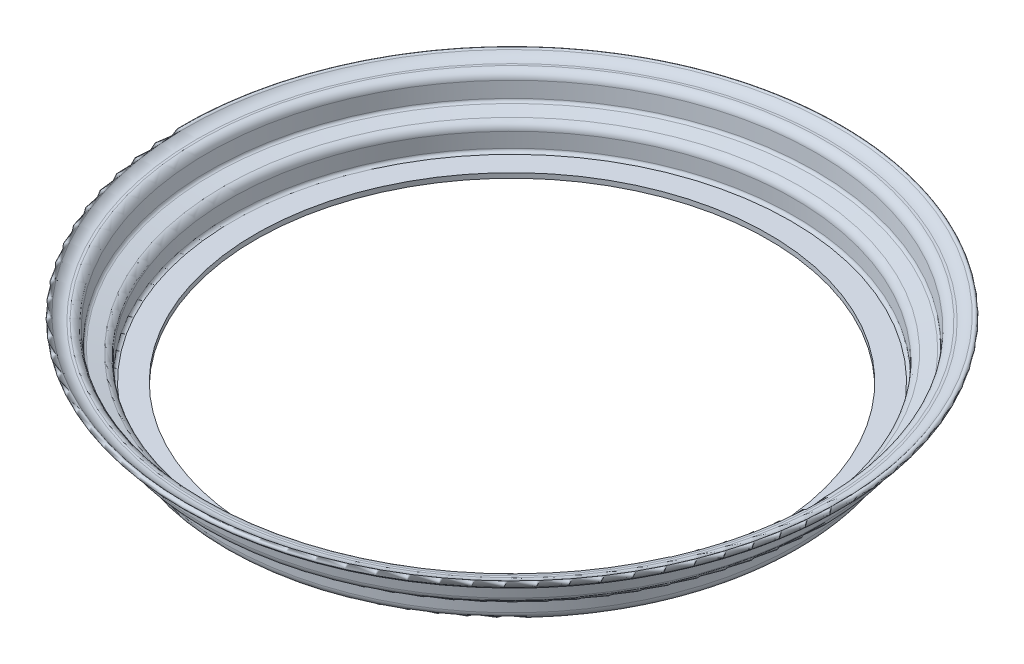
ISO-10303-21;
HEADER;
FILE_DESCRIPTION(('STEP AP214'),'2;1');
FILE_NAME('part.step','',(''),(''),'','','');
FILE_SCHEMA(('AUTOMOTIVE_DESIGN { 1 0 10303 214 1 1 1 1 }'));
ENDSEC;
DATA;
#1=APPLICATION_CONTEXT('core data for automotive mechanical design processes');
#2=APPLICATION_PROTOCOL_DEFINITION('international standard','automotive_design',2000,#1);
#3=PRODUCT_CONTEXT('',#1,'mechanical');
#4=PRODUCT('Part','Part','',(#3));
#5=PRODUCT_RELATED_PRODUCT_CATEGORY('part','',(#4));
#6=PRODUCT_DEFINITION_FORMATION('','',#4);
#7=PRODUCT_DEFINITION_CONTEXT('part definition',#1,'design');
#8=PRODUCT_DEFINITION('design','',#6,#7);
#9=PRODUCT_DEFINITION_SHAPE('','',#8);
#10=(LENGTH_UNIT() NAMED_UNIT(*) SI_UNIT(.MILLI.,.METRE.));
#11=(NAMED_UNIT(*) PLANE_ANGLE_UNIT() SI_UNIT($,.RADIAN.));
#12=(NAMED_UNIT(*) SI_UNIT($,.STERADIAN.) SOLID_ANGLE_UNIT());
#13=UNCERTAINTY_MEASURE_WITH_UNIT(LENGTH_MEASURE(1.E-05),#10,'distance_accuracy_value','');
#14=(GEOMETRIC_REPRESENTATION_CONTEXT(3) GLOBAL_UNCERTAINTY_ASSIGNED_CONTEXT((#13)) GLOBAL_UNIT_ASSIGNED_CONTEXT((#10,
#11,#12)) REPRESENTATION_CONTEXT('',''));
#15=CARTESIAN_POINT('',(0.,0.,0.));
#16=DIRECTION('',(0.,0.,1.));
#17=DIRECTION('',(1.,0.,0.));
#18=AXIS2_PLACEMENT_3D('',#15,#16,#17);
#19=CARTESIAN_POINT('',(0.,5.18,0.));
#20=DIRECTION('',(0.,1.,0.));
#21=DIRECTION('',(0.,0.,1.));
#22=AXIS2_PLACEMENT_3D('',#19,#20,#21);
#23=TOROIDAL_SURFACE('',#22,182.87389946701,5.17999999999999);
#24=CARTESIAN_POINT('',(0.,0.,0.));
#25=DIRECTION('',(0.,1.,0.));
#26=DIRECTION('',(0.,0.,1.));
#27=AXIS2_PLACEMENT_3D('',#24,#25,#26);
#28=CIRCLE('',#27,182.87389946701);
#29=CARTESIAN_POINT('',(0.,0.,182.87389946701));
#30=VERTEX_POINT('',#29);
#31=EDGE_CURVE('E10',#30,#30,#28,.T.);
#32=ORIENTED_EDGE('',*,*,#31,.T.);
#33=EDGE_LOOP('',(#32));
#34=FACE_BOUND('',#33,.T.);
#35=CARTESIAN_POINT('',(0.,5.18000000000005,0.));
#36=DIRECTION('',(0.,1.,0.));
#37=DIRECTION('',(0.,0.,1.));
#38=AXIS2_PLACEMENT_3D('',#35,#36,#37);
#39=CIRCLE('',#38,188.05389946701);
#40=CARTESIAN_POINT('',(0.,5.18000000000005,188.05389946701));
#41=VERTEX_POINT('',#40);
#42=EDGE_CURVE('E107',#41,#41,#39,.T.);
#43=ORIENTED_EDGE('',*,*,#42,.F.);
#44=EDGE_LOOP('',(#43));
#45=FACE_BOUND('',#44,.T.);
#46=ADVANCED_FACE('F37',(#34,#45),#23,.T.);
#47=CARTESIAN_POINT('',(-182.87389946701,0.,0.));
#48=DIRECTION('',(0.,-1.,0.));
#49=DIRECTION('',(0.,0.,-1.));
#50=AXIS2_PLACEMENT_3D('',#47,#48,#49);
#51=PLANE('',#50);
#52=CARTESIAN_POINT('',(0.,0.,0.));
#53=DIRECTION('',(0.,1.,0.));
#54=DIRECTION('',(0.,0.,1.));
#55=AXIS2_PLACEMENT_3D('',#52,#53,#54);
#56=CIRCLE('',#55,168.157575681218);
#57=CARTESIAN_POINT('',(0.,0.,168.157575681218));
#58=VERTEX_POINT('',#57);
#59=EDGE_CURVE('E43',#58,#58,#56,.T.);
#60=ORIENTED_EDGE('',*,*,#59,.T.);
#61=EDGE_LOOP('',(#60));
#62=FACE_BOUND('',#61,.T.);
#63=ORIENTED_EDGE('',*,*,#31,.F.);
#64=EDGE_LOOP('',(#63));
#65=FACE_BOUND('',#64,.T.);
#66=ADVANCED_FACE('F115',(#62,#65),#51,.T.);
#67=CARTESIAN_POINT('',(0.,240.88895216458,0.));
#68=DIRECTION('',(0.,1.,0.));
#69=DIRECTION('',(0.,0.,1.));
#70=AXIS2_PLACEMENT_3D('',#67,#68,#69);
#71=CYLINDRICAL_SURFACE('',#70,168.157575681218);
#72=CARTESIAN_POINT('',(0.,3.17500000000001,0.));
#73=DIRECTION('',(0.,1.,0.));
#74=DIRECTION('',(0.,0.,1.));
#75=AXIS2_PLACEMENT_3D('',#72,#73,#74);
#76=CIRCLE('',#75,168.157575681218);
#77=CARTESIAN_POINT('',(0.,3.17500000000001,168.157575681218));
#78=VERTEX_POINT('',#77);
#79=EDGE_CURVE('E47',#78,#78,#76,.T.);
#80=ORIENTED_EDGE('',*,*,#79,.T.);
#81=EDGE_LOOP('',(#80));
#82=FACE_BOUND('',#81,.T.);
#83=ORIENTED_EDGE('',*,*,#59,.F.);
#84=EDGE_LOOP('',(#83));
#85=FACE_BOUND('',#84,.T.);
#86=ADVANCED_FACE('F119',(#82,#85),#71,.F.);
#87=CARTESIAN_POINT('',(-182.87889946701,3.175,0.));
#88=DIRECTION('',(0.,1.,0.));
#89=DIRECTION('',(0.,0.,1.));
#90=AXIS2_PLACEMENT_3D('',#87,#88,#89);
#91=PLANE('',#90);
#92=CARTESIAN_POINT('',(0.,3.17500000000001,0.));
#93=DIRECTION('',(0.,1.,0.));
#94=DIRECTION('',(0.,0.,1.));
#95=AXIS2_PLACEMENT_3D('',#92,#93,#94);
#96=CIRCLE('',#95,182.87889946701);
#97=CARTESIAN_POINT('',(0.,3.17500000000001,182.87889946701));
#98=VERTEX_POINT('',#97);
#99=EDGE_CURVE('E51',#98,#98,#96,.T.);
#100=ORIENTED_EDGE('',*,*,#99,.T.);
#101=EDGE_LOOP('',(#100));
#102=FACE_BOUND('',#101,.T.);
#103=ORIENTED_EDGE('',*,*,#79,.F.);
#104=EDGE_LOOP('',(#103));
#105=FACE_BOUND('',#104,.T.);
#106=ADVANCED_FACE('F123',(#102,#105),#91,.T.);
#107=CARTESIAN_POINT('',(0.,5.175,0.));
#108=DIRECTION('',(0.,1.,0.));
#109=DIRECTION('',(0.,0.,1.));
#110=AXIS2_PLACEMENT_3D('',#107,#108,#109);
#111=TOROIDAL_SURFACE('',#110,182.87889946701,2.);
#112=CARTESIAN_POINT('',(0.,5.17500000000001,0.));
#113=DIRECTION('',(0.,1.,0.));
#114=DIRECTION('',(0.,0.,1.));
#115=AXIS2_PLACEMENT_3D('',#112,#113,#114);
#116=CIRCLE('',#115,184.87889946701);
#117=CARTESIAN_POINT('',(0.,5.17500000000001,184.87889946701));
#118=VERTEX_POINT('',#117);
#119=EDGE_CURVE('E56',#118,#118,#116,.T.);
#120=ORIENTED_EDGE('',*,*,#119,.T.);
#121=EDGE_LOOP('',(#120));
#122=FACE_BOUND('',#121,.T.);
#123=ORIENTED_EDGE('',*,*,#99,.F.);
#124=EDGE_LOOP('',(#123));
#125=FACE_BOUND('',#124,.T.);
#126=ADVANCED_FACE('F130',(#122,#125),#111,.F.);
#127=CARTESIAN_POINT('',(0.,240.88895216458,0.));
#128=DIRECTION('',(0.,1.,0.));
#129=DIRECTION('',(0.,0.,1.));
#130=AXIS2_PLACEMENT_3D('',#127,#128,#129);
#131=CYLINDRICAL_SURFACE('',#130,184.87889946701);
#132=CARTESIAN_POINT('',(0.,14.867499271066,0.));
#133=DIRECTION('',(0.,1.,0.));
#134=DIRECTION('',(0.,0.,1.));
#135=AXIS2_PLACEMENT_3D('',#132,#133,#134);
#136=CIRCLE('',#135,184.87889946701);
#137=CARTESIAN_POINT('',(0.,14.867499271066,184.87889946701));
#138=VERTEX_POINT('',#137);
#139=EDGE_CURVE('E59',#138,#138,#136,.T.);
#140=ORIENTED_EDGE('',*,*,#139,.T.);
#141=EDGE_LOOP('',(#140));
#142=FACE_BOUND('',#141,.T.);
#143=ORIENTED_EDGE('',*,*,#119,.F.);
#144=EDGE_LOOP('',(#143));
#145=FACE_BOUND('',#144,.T.);
#146=ADVANCED_FACE('F134',(#142,#145),#131,.F.);
#147=CARTESIAN_POINT('',(0.,14.867499271066,0.));
#148=DIRECTION('',(0.,1.,0.));
#149=DIRECTION('',(0.,0.,1.));
#150=AXIS2_PLACEMENT_3D('',#147,#148,#149);
#151=TOROIDAL_SURFACE('',#150,190.05889946701,5.17999999999999);
#152=CARTESIAN_POINT('',(0.,19.9153914307043,0.));
#153=DIRECTION('',(0.,1.,0.));
#154=DIRECTION('',(0.,0.,1.));
#155=AXIS2_PLACEMENT_3D('',#152,#153,#154);
#156=CIRCLE('',#155,188.896494742027);
#157=CARTESIAN_POINT('',(0.,19.9153914307043,188.896494742027));
#158=VERTEX_POINT('',#157);
#159=EDGE_CURVE('E62',#158,#158,#156,.T.);
#160=ORIENTED_EDGE('',*,*,#159,.T.);
#161=EDGE_LOOP('',(#160));
#162=FACE_BOUND('',#161,.T.);
#163=ORIENTED_EDGE('',*,*,#139,.F.);
#164=EDGE_LOOP('',(#163));
#165=FACE_BOUND('',#164,.T.);
#166=ADVANCED_FACE('F138',(#162,#165),#151,.T.);
#167=CARTESIAN_POINT('',(0.,19.9153914307043,0.));
#168=DIRECTION('',(0.,1.,0.));
#169=DIRECTION('',(0.,0.,1.));
#170=AXIS2_PLACEMENT_3D('',#167,#168,#169);
#171=CONICAL_SURFACE('',#170,188.896494742027,1.3444665156361);
#172=CARTESIAN_POINT('',(0.,21.8526178798795,0.));
#173=DIRECTION('',(0.,1.,0.));
#174=DIRECTION('',(0.,0.,1.));
#175=AXIS2_PLACEMENT_3D('',#172,#173,#174);
#176=CIRCLE('',#175,197.309149985129);
#177=CARTESIAN_POINT('',(0.,21.8526178798795,197.309149985129));
#178=VERTEX_POINT('',#177);
#179=EDGE_CURVE('E65',#178,#178,#176,.T.);
#180=ORIENTED_EDGE('',*,*,#179,.T.);
#181=EDGE_LOOP('',(#180));
#182=FACE_BOUND('',#181,.T.);
#183=ORIENTED_EDGE('',*,*,#159,.F.);
#184=EDGE_LOOP('',(#183));
#185=FACE_BOUND('',#184,.T.);
#186=ADVANCED_FACE('F142',(#182,#185),#171,.F.);
#187=CARTESIAN_POINT('',(0.,23.801610991709,0.));
#188=DIRECTION('',(0.,1.,0.));
#189=DIRECTION('',(0.,0.,1.));
#190=AXIS2_PLACEMENT_3D('',#187,#188,#189);
#191=TOROIDAL_SURFACE('',#190,196.860345072008,2.);
#192=CARTESIAN_POINT('',(0.,23.6272995062136,0.));
#193=DIRECTION('',(0.,1.,0.));
#194=DIRECTION('',(0.,0.,1.));
#195=AXIS2_PLACEMENT_3D('',#192,#193,#194);
#196=CIRCLE('',#195,198.852734468192);
#197=CARTESIAN_POINT('',(0.,23.6272995062136,198.852734468192));
#198=VERTEX_POINT('',#197);
#199=EDGE_CURVE('E68',#198,#198,#196,.T.);
#200=ORIENTED_EDGE('',*,*,#199,.T.);
#201=EDGE_LOOP('',(#200));
#202=FACE_BOUND('',#201,.T.);
#203=ORIENTED_EDGE('',*,*,#179,.F.);
#204=EDGE_LOOP('',(#203));
#205=FACE_BOUND('',#204,.T.);
#206=ADVANCED_FACE('F146',(#202,#205),#191,.F.);
#207=CARTESIAN_POINT('',(0.,23.6272995062136,0.));
#208=DIRECTION('',(0.,1.,0.));
#209=DIRECTION('',(0.,0.,1.));
#210=AXIS2_PLACEMENT_3D('',#207,#208,#209);
#211=CONICAL_SURFACE('',#210,198.852734468192,0.0872664625997168);
#212=CARTESIAN_POINT('',(0.,33.3330306370932,0.));
#213=DIRECTION('',(0.,1.,0.));
#214=DIRECTION('',(0.,0.,1.));
#215=AXIS2_PLACEMENT_3D('',#212,#213,#214);
#216=CIRCLE('',#215,199.701875913375);
#217=CARTESIAN_POINT('',(0.,33.3330306370932,199.701875913375));
#218=VERTEX_POINT('',#217);
#219=EDGE_CURVE('E71',#218,#218,#216,.T.);
#220=ORIENTED_EDGE('',*,*,#219,.T.);
#221=EDGE_LOOP('',(#220));
#222=FACE_BOUND('',#221,.T.);
#223=ORIENTED_EDGE('',*,*,#199,.F.);
#224=EDGE_LOOP('',(#223));
#225=FACE_BOUND('',#224,.T.);
#226=ADVANCED_FACE('F150',(#222,#225),#211,.F.);
#227=CARTESIAN_POINT('',(0.,32.881999668374,0.));
#228=DIRECTION('',(0.,1.,0.));
#229=DIRECTION('',(0.,0.,1.));
#230=AXIS2_PLACEMENT_3D('',#227,#228,#229);
#231=TOROIDAL_SURFACE('',#230,204.857183476,5.17500000000078);
#232=CARTESIAN_POINT('',(0.,38.0569996683748,0.));
#233=DIRECTION('',(0.,1.,0.));
#234=DIRECTION('',(0.,0.,1.));
#235=AXIS2_PLACEMENT_3D('',#232,#233,#234);
#236=CIRCLE('',#235,204.857183476);
#237=CARTESIAN_POINT('',(0.,38.0569996683748,204.857183476));
#238=VERTEX_POINT('',#237);
#239=EDGE_CURVE('E74',#238,#238,#236,.T.);
#240=ORIENTED_EDGE('',*,*,#239,.T.);
#241=EDGE_LOOP('',(#240));
#242=FACE_BOUND('',#241,.T.);
#243=ORIENTED_EDGE('',*,*,#219,.F.);
#244=EDGE_LOOP('',(#243));
#245=FACE_BOUND('',#244,.T.);
#246=ADVANCED_FACE('F154',(#242,#245),#231,.T.);
#247=CARTESIAN_POINT('',(-204.857183476,38.0569996683742,0.));
#248=DIRECTION('',(0.,1.,0.));
#249=DIRECTION('',(0.,0.,1.));
#250=AXIS2_PLACEMENT_3D('',#247,#248,#249);
#251=PLANE('',#250);
#252=CARTESIAN_POINT('',(0.,38.0569996683736,0.));
#253=DIRECTION('',(0.,1.,0.));
#254=DIRECTION('',(0.,0.,1.));
#255=AXIS2_PLACEMENT_3D('',#252,#253,#254);
#256=CIRCLE('',#255,206.357183498617);
#257=CARTESIAN_POINT('',(0.,38.0569996683736,206.357183498617));
#258=VERTEX_POINT('',#257);
#259=EDGE_CURVE('E77',#258,#258,#256,.T.);
#260=ORIENTED_EDGE('',*,*,#259,.T.);
#261=EDGE_LOOP('',(#260));
#262=FACE_BOUND('',#261,.T.);
#263=ORIENTED_EDGE('',*,*,#239,.F.);
#264=EDGE_LOOP('',(#263));
#265=FACE_BOUND('',#264,.T.);
#266=ADVANCED_FACE('F158',(#262,#265),#251,.T.);
#267=CARTESIAN_POINT('',(0.,47.4389997084663,0.));
#268=DIRECTION('',(0.,1.,0.));
#269=DIRECTION('',(0.,0.,1.));
#270=AXIS2_PLACEMENT_3D('',#267,#268,#269);
#271=TOROIDAL_SURFACE('',#270,206.357183566697,9.38200004009267);
#272=CARTESIAN_POINT('',(0.,41.1399264458523,0.));
#273=DIRECTION('',(0.,1.,0.));
#274=DIRECTION('',(0.,0.,1.));
#275=AXIS2_PLACEMENT_3D('',#272,#273,#274);
#276=CIRCLE('',#275,213.310139828929);
#277=CARTESIAN_POINT('',(0.,41.1399264458523,213.310139828929));
#278=VERTEX_POINT('',#277);
#279=EDGE_CURVE('E80',#278,#278,#276,.T.);
#280=ORIENTED_EDGE('',*,*,#279,.T.);
#281=EDGE_LOOP('',(#280));
#282=FACE_BOUND('',#281,.T.);
#283=ORIENTED_EDGE('',*,*,#259,.F.);
#284=EDGE_LOOP('',(#283));
#285=FACE_BOUND('',#284,.T.);
#286=ADVANCED_FACE('F162',(#282,#285),#271,.F.);
#287=CARTESIAN_POINT('',(0.,40.0932141057942,0.));
#288=DIRECTION('',(0.,1.,0.));
#289=DIRECTION('',(0.,0.,1.));
#290=AXIS2_PLACEMENT_3D('',#287,#288,#289);
#291=TOROIDAL_SURFACE('',#290,214.465507422888,1.55900000000074);
#292=CARTESIAN_POINT('',(0.,39.0465017657306,0.));
#293=DIRECTION('',(0.,1.,0.));
#294=DIRECTION('',(0.,0.,1.));
#295=AXIS2_PLACEMENT_3D('',#292,#293,#294);
#296=CIRCLE('',#295,215.620875016844);
#297=CARTESIAN_POINT('',(0.,39.0465017657306,215.620875016844));
#298=VERTEX_POINT('',#297);
#299=EDGE_CURVE('E83',#298,#298,#296,.T.);
#300=ORIENTED_EDGE('',*,*,#299,.T.);
#301=EDGE_LOOP('',(#300));
#302=FACE_BOUND('',#301,.T.);
#303=ORIENTED_EDGE('',*,*,#279,.F.);
#304=EDGE_LOOP('',(#303));
#305=FACE_BOUND('',#304,.T.);
#306=ADVANCED_FACE('F166',(#302,#305),#291,.T.);
#307=CARTESIAN_POINT('',(0.,47.3818939617421,0.));
#308=DIRECTION('',(0.,1.,0.));
#309=DIRECTION('',(0.,0.,1.));
#310=AXIS2_PLACEMENT_3D('',#307,#308,#309);
#311=TOROIDAL_SURFACE('',#310,206.305766969097,12.5000000401009);
#312=CARTESIAN_POINT('',(0.,34.8819996683748,0.));
#313=DIRECTION('',(0.,1.,0.));
#314=DIRECTION('',(0.,0.,1.));
#315=AXIS2_PLACEMENT_3D('',#312,#313,#314);
#316=CIRCLE('',#315,206.357183475997);
#317=CARTESIAN_POINT('',(0.,34.8819996683748,206.357183475997));
#318=VERTEX_POINT('',#317);
#319=EDGE_CURVE('E86',#318,#318,#316,.T.);
#320=ORIENTED_EDGE('',*,*,#319,.T.);
#321=EDGE_LOOP('',(#320));
#322=FACE_BOUND('',#321,.T.);
#323=ORIENTED_EDGE('',*,*,#299,.F.);
#324=EDGE_LOOP('',(#323));
#325=FACE_BOUND('',#324,.T.);
#326=ADVANCED_FACE('F170',(#322,#325),#311,.T.);
#327=CARTESIAN_POINT('',(-206.357183475997,34.8819996683748,0.));
#328=DIRECTION('',(0.,-1.,0.));
#329=DIRECTION('',(0.,0.,-1.));
#330=AXIS2_PLACEMENT_3D('',#327,#328,#329);
#331=PLANE('',#330);
#332=CARTESIAN_POINT('',(0.,34.8819996683748,0.));
#333=DIRECTION('',(0.,1.,0.));
#334=DIRECTION('',(0.,0.,1.));
#335=AXIS2_PLACEMENT_3D('',#332,#333,#334);
#336=CIRCLE('',#335,204.857183475997);
#337=CARTESIAN_POINT('',(0.,34.8819996683748,204.857183475997));
#338=VERTEX_POINT('',#337);
#339=EDGE_CURVE('E89',#338,#338,#336,.T.);
#340=ORIENTED_EDGE('',*,*,#339,.T.);
#341=EDGE_LOOP('',(#340));
#342=FACE_BOUND('',#341,.T.);
#343=ORIENTED_EDGE('',*,*,#319,.F.);
#344=EDGE_LOOP('',(#343));
#345=FACE_BOUND('',#344,.T.);
#346=ADVANCED_FACE('F174',(#342,#345),#331,.T.);
#347=CARTESIAN_POINT('',(0.,32.881999668374,0.));
#348=DIRECTION('',(0.,1.,0.));
#349=DIRECTION('',(0.,0.,1.));
#350=AXIS2_PLACEMENT_3D('',#347,#348,#349);
#351=TOROIDAL_SURFACE('',#350,204.857183476,2.00000000000078);
#352=CARTESIAN_POINT('',(0.,33.0563111538694,0.));
#353=DIRECTION('',(0.,1.,0.));
#354=DIRECTION('',(0.,0.,1.));
#355=AXIS2_PLACEMENT_3D('',#352,#353,#354);
#356=CIRCLE('',#355,202.864794079816);
#357=CARTESIAN_POINT('',(0.,33.0563111538694,202.864794079816));
#358=VERTEX_POINT('',#357);
#359=EDGE_CURVE('E92',#358,#358,#356,.T.);
#360=ORIENTED_EDGE('',*,*,#359,.T.);
#361=EDGE_LOOP('',(#360));
#362=FACE_BOUND('',#361,.T.);
#363=ORIENTED_EDGE('',*,*,#339,.F.);
#364=EDGE_LOOP('',(#363));
#365=FACE_BOUND('',#364,.T.);
#366=ADVANCED_FACE('F178',(#362,#365),#351,.F.);
#367=CARTESIAN_POINT('',(0.,33.0563111538694,0.));
#368=DIRECTION('',(0.,1.,0.));
#369=DIRECTION('',(0.,0.,1.));
#370=AXIS2_PLACEMENT_3D('',#367,#368,#369);
#371=CONICAL_SURFACE('',#370,202.864794079816,0.0872664625997167);
#372=CARTESIAN_POINT('',(0.,23.3542010547533,0.));
#373=DIRECTION('',(0.,1.,0.));
#374=DIRECTION('',(0.,0.,1.));
#375=AXIS2_PLACEMENT_3D('',#372,#373,#374);
#376=CIRCLE('',#375,202.015969433863);
#377=CARTESIAN_POINT('',(0.,23.3542010547533,202.015969433863));
#378=VERTEX_POINT('',#377);
#379=EDGE_CURVE('E95',#378,#378,#376,.T.);
#380=ORIENTED_EDGE('',*,*,#379,.T.);
#381=EDGE_LOOP('',(#380));
#382=FACE_BOUND('',#381,.T.);
#383=ORIENTED_EDGE('',*,*,#359,.F.);
#384=EDGE_LOOP('',(#383));
#385=FACE_BOUND('',#384,.T.);
#386=ADVANCED_FACE('F182',(#382,#385),#371,.T.);
#387=CARTESIAN_POINT('',(0.,23.8056678021862,0.));
#388=DIRECTION('',(0.,1.,0.));
#389=DIRECTION('',(0.,0.,1.));
#390=AXIS2_PLACEMENT_3D('',#387,#388,#389);
#391=TOROIDAL_SURFACE('',#390,196.855680897748,5.18);
#392=CARTESIAN_POINT('',(0.,18.7577756425479,0.));
#393=DIRECTION('',(0.,1.,0.));
#394=DIRECTION('',(0.,0.,1.));
#395=AXIS2_PLACEMENT_3D('',#392,#393,#394);
#396=CIRCLE('',#395,198.018085622731);
#397=CARTESIAN_POINT('',(0.,18.7577756425479,198.018085622731));
#398=VERTEX_POINT('',#397);
#399=EDGE_CURVE('E98',#398,#398,#396,.T.);
#400=ORIENTED_EDGE('',*,*,#399,.T.);
#401=EDGE_LOOP('',(#400));
#402=FACE_BOUND('',#401,.T.);
#403=ORIENTED_EDGE('',*,*,#379,.F.);
#404=EDGE_LOOP('',(#403));
#405=FACE_BOUND('',#404,.T.);
#406=ADVANCED_FACE('F186',(#402,#405),#391,.T.);
#407=CARTESIAN_POINT('',(0.,18.7577756425479,0.));
#408=DIRECTION('',(0.,1.,0.));
#409=DIRECTION('',(0.,0.,1.));
#410=AXIS2_PLACEMENT_3D('',#407,#408,#409);
#411=CONICAL_SURFACE('',#410,198.018085622731,1.3444665156361);
#412=CARTESIAN_POINT('',(0.,16.8204718610103,0.));
#413=DIRECTION('',(0.,1.,0.));
#414=DIRECTION('',(0.,0.,1.));
#415=AXIS2_PLACEMENT_3D('',#412,#413,#414);
#416=CIRCLE('',#415,189.605094553889);
#417=CARTESIAN_POINT('',(0.,16.8204718610103,189.605094553889));
#418=VERTEX_POINT('',#417);
#419=EDGE_CURVE('E101',#418,#418,#416,.T.);
#420=ORIENTED_EDGE('',*,*,#419,.T.);
#421=EDGE_LOOP('',(#420));
#422=FACE_BOUND('',#421,.T.);
#423=ORIENTED_EDGE('',*,*,#399,.F.);
#424=EDGE_LOOP('',(#423));
#425=FACE_BOUND('',#424,.T.);
#426=ADVANCED_FACE('F190',(#422,#425),#411,.T.);
#427=CARTESIAN_POINT('',(0.,14.8714787491808,0.));
#428=DIRECTION('',(0.,1.,0.));
#429=DIRECTION('',(0.,0.,1.));
#430=AXIS2_PLACEMENT_3D('',#427,#428,#429);
#431=TOROIDAL_SURFACE('',#430,190.05389946701,2.);
#432=CARTESIAN_POINT('',(0.,14.8714787491808,0.));
#433=DIRECTION('',(0.,1.,0.));
#434=DIRECTION('',(0.,0.,1.));
#435=AXIS2_PLACEMENT_3D('',#432,#433,#434);
#436=CIRCLE('',#435,188.05389946701);
#437=CARTESIAN_POINT('',(0.,14.8714787491808,188.05389946701));
#438=VERTEX_POINT('',#437);
#439=EDGE_CURVE('E104',#438,#438,#436,.T.);
#440=ORIENTED_EDGE('',*,*,#439,.T.);
#441=EDGE_LOOP('',(#440));
#442=FACE_BOUND('',#441,.T.);
#443=ORIENTED_EDGE('',*,*,#419,.F.);
#444=EDGE_LOOP('',(#443));
#445=FACE_BOUND('',#444,.T.);
#446=ADVANCED_FACE('F194',(#442,#445),#431,.F.);
#447=CARTESIAN_POINT('',(0.,240.88895216458,0.));
#448=DIRECTION('',(0.,1.,0.));
#449=DIRECTION('',(0.,0.,1.));
#450=AXIS2_PLACEMENT_3D('',#447,#448,#449);
#451=CYLINDRICAL_SURFACE('',#450,188.05389946701);
#452=ORIENTED_EDGE('',*,*,#42,.T.);
#453=EDGE_LOOP('',(#452));
#454=FACE_BOUND('',#453,.T.);
#455=ORIENTED_EDGE('',*,*,#439,.F.);
#456=EDGE_LOOP('',(#455));
#457=FACE_BOUND('',#456,.T.);
#458=ADVANCED_FACE('F111',(#454,#457),#451,.T.);
#459=CLOSED_SHELL('',(#46,#66,#86,#106,#126,#146,#166,#186,#206,#226,#246,#266,#286,#306,#326,
#346,#366,#386,#406,#426,#446,#458));
#460=MANIFOLD_SOLID_BREP('B2',#459);
#461=ADVANCED_BREP_SHAPE_REPRESENTATION('',(#18,#460),#14);
#462=SHAPE_DEFINITION_REPRESENTATION(#9,#461);
ENDSEC;
END-ISO-10303-21;
